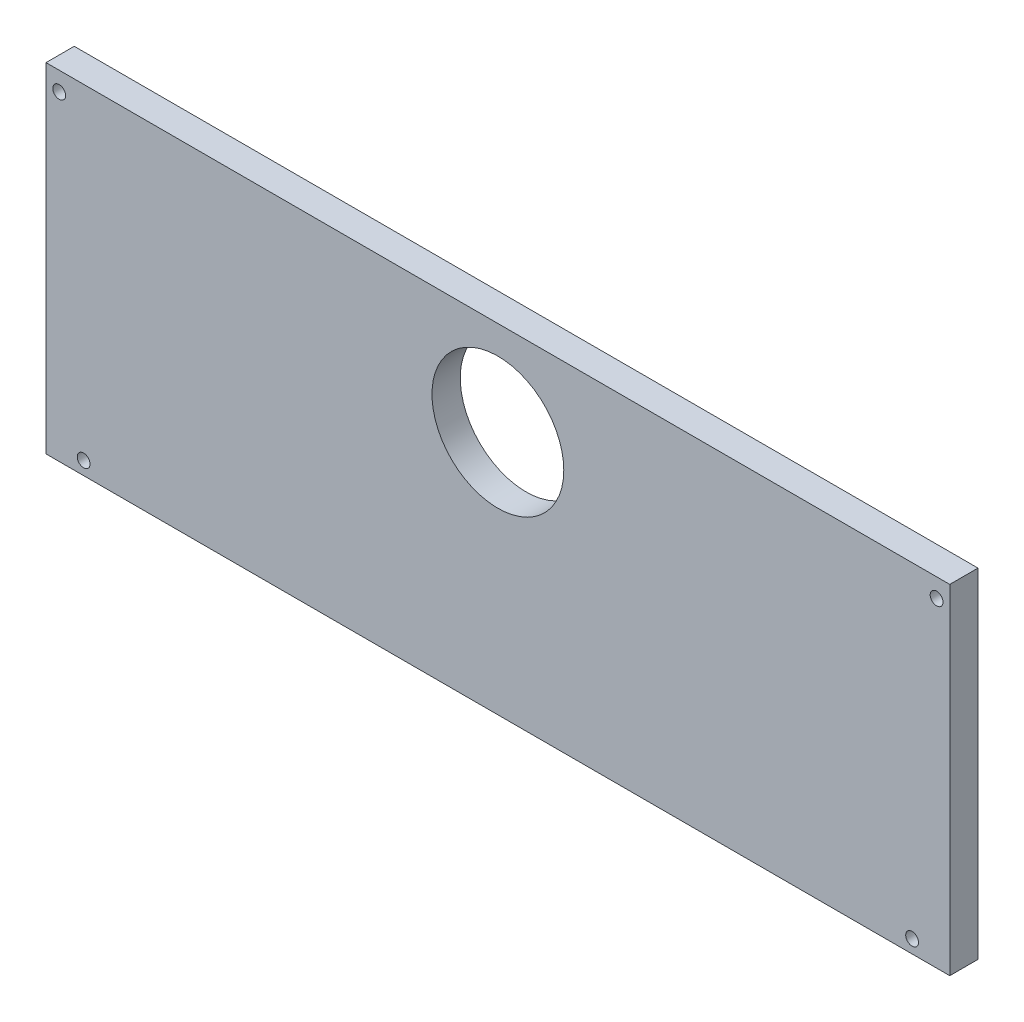
ISO-10303-21;
HEADER;
FILE_DESCRIPTION(('STEP AP214'),'2;1');
FILE_NAME('part.step','',(''),(''),'','','');
FILE_SCHEMA(('AUTOMOTIVE_DESIGN { 1 0 10303 214 1 1 1 1 }'));
ENDSEC;
DATA;
#1=APPLICATION_CONTEXT('core data for automotive mechanical design processes');
#2=APPLICATION_PROTOCOL_DEFINITION('international standard','automotive_design',2000,#1);
#3=PRODUCT_CONTEXT('',#1,'mechanical');
#4=PRODUCT('Part','Part','',(#3));
#5=PRODUCT_RELATED_PRODUCT_CATEGORY('part','',(#4));
#6=PRODUCT_DEFINITION_FORMATION('','',#4);
#7=PRODUCT_DEFINITION_CONTEXT('part definition',#1,'design');
#8=PRODUCT_DEFINITION('design','',#6,#7);
#9=PRODUCT_DEFINITION_SHAPE('','',#8);
#10=(LENGTH_UNIT() NAMED_UNIT(*) SI_UNIT(.MILLI.,.METRE.));
#11=(NAMED_UNIT(*) PLANE_ANGLE_UNIT() SI_UNIT($,.RADIAN.));
#12=(NAMED_UNIT(*) SI_UNIT($,.STERADIAN.) SOLID_ANGLE_UNIT());
#13=UNCERTAINTY_MEASURE_WITH_UNIT(LENGTH_MEASURE(1.E-05),#10,'distance_accuracy_value','');
#14=(GEOMETRIC_REPRESENTATION_CONTEXT(3) GLOBAL_UNCERTAINTY_ASSIGNED_CONTEXT((#13)) GLOBAL_UNIT_ASSIGNED_CONTEXT((#10,
#11,#12)) REPRESENTATION_CONTEXT('',''));
#15=CARTESIAN_POINT('',(0.,0.,0.));
#16=DIRECTION('',(0.,0.,1.));
#17=DIRECTION('',(1.,0.,0.));
#18=AXIS2_PLACEMENT_3D('',#15,#16,#17);
#19=CARTESIAN_POINT('',(0.,0.,9.525));
#20=DIRECTION('',(0.,0.,-1.));
#21=DIRECTION('',(-1.,0.,0.));
#22=AXIS2_PLACEMENT_3D('',#19,#20,#21);
#23=PLANE('',#22);
#24=CARTESIAN_POINT('',(139.7,-78.105,9.525));
#25=DIRECTION('',(0.,0.,1.));
#26=DIRECTION('',(1.,0.,0.));
#27=AXIS2_PLACEMENT_3D('',#24,#25,#26);
#28=CIRCLE('',#27,2.15899999999999);
#29=CARTESIAN_POINT('',(141.859,-78.105,9.525));
#30=VERTEX_POINT('',#29);
#31=EDGE_CURVE('E148',#30,#30,#28,.T.);
#32=ORIENTED_EDGE('',*,*,#31,.F.);
#33=EDGE_LOOP('',(#32));
#34=FACE_BOUND('',#33,.T.);
#35=CARTESIAN_POINT('',(147.955,25.4,9.525));
#36=DIRECTION('',(0.,0.,1.));
#37=DIRECTION('',(1.,0.,0.));
#38=AXIS2_PLACEMENT_3D('',#35,#36,#37);
#39=CIRCLE('',#38,2.15899999999999);
#40=CARTESIAN_POINT('',(150.114,25.4,9.525));
#41=VERTEX_POINT('',#40);
#42=EDGE_CURVE('E156',#41,#41,#39,.T.);
#43=ORIENTED_EDGE('',*,*,#42,.F.);
#44=EDGE_LOOP('',(#43));
#45=FACE_BOUND('',#44,.T.);
#46=CARTESIAN_POINT('',(-147.955,25.4,9.525));
#47=DIRECTION('',(0.,0.,1.));
#48=DIRECTION('',(1.,0.,0.));
#49=AXIS2_PLACEMENT_3D('',#46,#47,#48);
#50=CIRCLE('',#49,2.15899999999999);
#51=CARTESIAN_POINT('',(-145.796,25.4,9.525));
#52=VERTEX_POINT('',#51);
#53=EDGE_CURVE('E164',#52,#52,#50,.T.);
#54=ORIENTED_EDGE('',*,*,#53,.F.);
#55=EDGE_LOOP('',(#54));
#56=FACE_BOUND('',#55,.T.);
#57=CARTESIAN_POINT('',(-139.7,-78.105,9.525));
#58=DIRECTION('',(0.,0.,1.));
#59=DIRECTION('',(1.,0.,0.));
#60=AXIS2_PLACEMENT_3D('',#57,#58,#59);
#61=CIRCLE('',#60,2.15899999999999);
#62=CARTESIAN_POINT('',(-137.541,-78.105,9.525));
#63=VERTEX_POINT('',#62);
#64=EDGE_CURVE('E140',#63,#63,#61,.T.);
#65=ORIENTED_EDGE('',*,*,#64,.F.);
#66=EDGE_LOOP('',(#65));
#67=FACE_BOUND('',#66,.T.);
#68=DIRECTION('',(0.,-1.,0.));
#69=VECTOR('',#68,1.);
#70=CARTESIAN_POINT('',(-152.4,-82.55,9.525));
#71=LINE('',#70,#69);
#72=CARTESIAN_POINT('',(-152.4,31.75,9.525));
#73=VERTEX_POINT('',#72);
#74=CARTESIAN_POINT('',(-152.4,-82.55,9.525));
#75=VERTEX_POINT('',#74);
#76=EDGE_CURVE('E94',#73,#75,#71,.T.);
#77=ORIENTED_EDGE('',*,*,#76,.T.);
#78=DIRECTION('',(1.,0.,0.));
#79=VECTOR('',#78,1.);
#80=CARTESIAN_POINT('',(-152.4,-82.55,9.525));
#81=LINE('',#80,#79);
#82=CARTESIAN_POINT('',(152.4,-82.55,9.525));
#83=VERTEX_POINT('',#82);
#84=EDGE_CURVE('E89',#75,#83,#81,.T.);
#85=ORIENTED_EDGE('',*,*,#84,.T.);
#86=DIRECTION('',(0.,1.,0.));
#87=VECTOR('',#86,1.);
#88=CARTESIAN_POINT('',(152.4,-82.55,9.525));
#89=LINE('',#88,#87);
#90=CARTESIAN_POINT('',(152.4,31.75,9.525));
#91=VERTEX_POINT('',#90);
#92=EDGE_CURVE('E92',#83,#91,#89,.T.);
#93=ORIENTED_EDGE('',*,*,#92,.T.);
#94=DIRECTION('',(-1.,0.,0.));
#95=VECTOR('',#94,1.);
#96=CARTESIAN_POINT('',(-152.4,31.75,9.525));
#97=LINE('',#96,#95);
#98=EDGE_CURVE('E59',#91,#73,#97,.T.);
#99=ORIENTED_EDGE('',*,*,#98,.T.);
#100=EDGE_LOOP('',(#77,#85,#93,#99));
#101=FACE_BOUND('',#100,.T.);
#102=CARTESIAN_POINT('',(0.,0.,9.525));
#103=DIRECTION('',(0.,0.,1.));
#104=DIRECTION('',(1.,0.,0.));
#105=AXIS2_PLACEMENT_3D('',#102,#103,#104);
#106=CIRCLE('',#105,22.225);
#107=CARTESIAN_POINT('',(22.225,0.,9.525));
#108=VERTEX_POINT('',#107);
#109=EDGE_CURVE('E114',#108,#108,#106,.T.);
#110=ORIENTED_EDGE('',*,*,#109,.F.);
#111=EDGE_LOOP('',(#110));
#112=FACE_BOUND('',#111,.T.);
#113=ADVANCED_FACE('F41',(#34,#45,#56,#67,#101,#112),#23,.F.);
#114=CARTESIAN_POINT('',(0.,0.,0.));
#115=DIRECTION('',(0.,0.,-1.));
#116=DIRECTION('',(-1.,0.,0.));
#117=AXIS2_PLACEMENT_3D('',#114,#115,#116);
#118=PLANE('',#117);
#119=CARTESIAN_POINT('',(139.7,-78.105,0.));
#120=DIRECTION('',(0.,0.,1.));
#121=DIRECTION('',(1.,0.,0.));
#122=AXIS2_PLACEMENT_3D('',#119,#120,#121);
#123=CIRCLE('',#122,2.15899999999999);
#124=CARTESIAN_POINT('',(141.859,-78.105,0.));
#125=VERTEX_POINT('',#124);
#126=EDGE_CURVE('E152',#125,#125,#123,.T.);
#127=ORIENTED_EDGE('',*,*,#126,.T.);
#128=EDGE_LOOP('',(#127));
#129=FACE_BOUND('',#128,.T.);
#130=CARTESIAN_POINT('',(147.955,25.4,0.));
#131=DIRECTION('',(0.,0.,1.));
#132=DIRECTION('',(1.,0.,0.));
#133=AXIS2_PLACEMENT_3D('',#130,#131,#132);
#134=CIRCLE('',#133,2.15899999999999);
#135=CARTESIAN_POINT('',(150.114,25.4,0.));
#136=VERTEX_POINT('',#135);
#137=EDGE_CURVE('E160',#136,#136,#134,.T.);
#138=ORIENTED_EDGE('',*,*,#137,.T.);
#139=EDGE_LOOP('',(#138));
#140=FACE_BOUND('',#139,.T.);
#141=CARTESIAN_POINT('',(-147.955,25.4,0.));
#142=DIRECTION('',(0.,0.,1.));
#143=DIRECTION('',(1.,0.,0.));
#144=AXIS2_PLACEMENT_3D('',#141,#142,#143);
#145=CIRCLE('',#144,2.15899999999999);
#146=CARTESIAN_POINT('',(-145.796,25.4,0.));
#147=VERTEX_POINT('',#146);
#148=EDGE_CURVE('E144',#147,#147,#145,.T.);
#149=ORIENTED_EDGE('',*,*,#148,.T.);
#150=EDGE_LOOP('',(#149));
#151=FACE_BOUND('',#150,.T.);
#152=CARTESIAN_POINT('',(-139.7,-78.105,0.));
#153=DIRECTION('',(0.,0.,1.));
#154=DIRECTION('',(1.,0.,0.));
#155=AXIS2_PLACEMENT_3D('',#152,#153,#154);
#156=CIRCLE('',#155,2.15899999999999);
#157=CARTESIAN_POINT('',(-137.541,-78.105,0.));
#158=VERTEX_POINT('',#157);
#159=EDGE_CURVE('E136',#158,#158,#156,.T.);
#160=ORIENTED_EDGE('',*,*,#159,.T.);
#161=EDGE_LOOP('',(#160));
#162=FACE_BOUND('',#161,.T.);
#163=DIRECTION('',(0.,-1.,0.));
#164=VECTOR('',#163,1.);
#165=CARTESIAN_POINT('',(-152.4,-82.55,0.));
#166=LINE('',#165,#164);
#167=CARTESIAN_POINT('',(-152.4,31.75,0.));
#168=VERTEX_POINT('',#167);
#169=CARTESIAN_POINT('',(-152.4,-82.55,0.));
#170=VERTEX_POINT('',#169);
#171=EDGE_CURVE('E110',#168,#170,#166,.T.);
#172=ORIENTED_EDGE('',*,*,#171,.F.);
#173=DIRECTION('',(-1.,0.,0.));
#174=VECTOR('',#173,1.);
#175=CARTESIAN_POINT('',(-152.4,31.75,0.));
#176=LINE('',#175,#174);
#177=CARTESIAN_POINT('',(152.4,31.75,0.));
#178=VERTEX_POINT('',#177);
#179=EDGE_CURVE('E82',#178,#168,#176,.T.);
#180=ORIENTED_EDGE('',*,*,#179,.F.);
#181=DIRECTION('',(0.,1.,0.));
#182=VECTOR('',#181,1.);
#183=CARTESIAN_POINT('',(152.4,-82.55,0.));
#184=LINE('',#183,#182);
#185=CARTESIAN_POINT('',(152.4,-82.55,0.));
#186=VERTEX_POINT('',#185);
#187=EDGE_CURVE('E76',#186,#178,#184,.T.);
#188=ORIENTED_EDGE('',*,*,#187,.F.);
#189=DIRECTION('',(1.,0.,0.));
#190=VECTOR('',#189,1.);
#191=CARTESIAN_POINT('',(-152.4,-82.55,0.));
#192=LINE('',#191,#190);
#193=EDGE_CURVE('E99',#170,#186,#192,.T.);
#194=ORIENTED_EDGE('',*,*,#193,.F.);
#195=EDGE_LOOP('',(#172,#180,#188,#194));
#196=FACE_BOUND('',#195,.T.);
#197=CARTESIAN_POINT('',(0.,0.,0.));
#198=DIRECTION('',(0.,0.,1.));
#199=DIRECTION('',(1.,0.,0.));
#200=AXIS2_PLACEMENT_3D('',#197,#198,#199);
#201=CIRCLE('',#200,22.225);
#202=CARTESIAN_POINT('',(22.225,0.,0.));
#203=VERTEX_POINT('',#202);
#204=EDGE_CURVE('E132',#203,#203,#201,.T.);
#205=ORIENTED_EDGE('',*,*,#204,.T.);
#206=EDGE_LOOP('',(#205));
#207=FACE_BOUND('',#206,.T.);
#208=ADVANCED_FACE('F127',(#129,#140,#151,#162,#196,#207),#118,.T.);
#209=CARTESIAN_POINT('',(-152.4,-82.55,9.525));
#210=DIRECTION('',(1.,0.,0.));
#211=DIRECTION('',(0.,0.,-1.));
#212=AXIS2_PLACEMENT_3D('',#209,#210,#211);
#213=PLANE('',#212);
#214=ORIENTED_EDGE('',*,*,#171,.T.);
#215=DIRECTION('',(0.,0.,-1.));
#216=VECTOR('',#215,1.);
#217=CARTESIAN_POINT('',(-152.4,-82.55,9.525));
#218=LINE('',#217,#216);
#219=EDGE_CURVE('E11',#75,#170,#218,.T.);
#220=ORIENTED_EDGE('',*,*,#219,.F.);
#221=ORIENTED_EDGE('',*,*,#76,.F.);
#222=DIRECTION('',(0.,0.,-1.));
#223=VECTOR('',#222,1.);
#224=CARTESIAN_POINT('',(-152.4,31.75,9.525));
#225=LINE('',#224,#223);
#226=EDGE_CURVE('E106',#73,#168,#225,.T.);
#227=ORIENTED_EDGE('',*,*,#226,.T.);
#228=EDGE_LOOP('',(#214,#220,#221,#227));
#229=FACE_BOUND('',#228,.T.);
#230=ADVANCED_FACE('F43',(#229),#213,.F.);
#231=CARTESIAN_POINT('',(-152.4,-82.55,9.525));
#232=DIRECTION('',(0.,1.,0.));
#233=DIRECTION('',(0.,0.,1.));
#234=AXIS2_PLACEMENT_3D('',#231,#232,#233);
#235=PLANE('',#234);
#236=ORIENTED_EDGE('',*,*,#193,.T.);
#237=DIRECTION('',(0.,0.,-1.));
#238=VECTOR('',#237,1.);
#239=CARTESIAN_POINT('',(152.4,-82.55,9.525));
#240=LINE('',#239,#238);
#241=EDGE_CURVE('E51',#83,#186,#240,.T.);
#242=ORIENTED_EDGE('',*,*,#241,.F.);
#243=ORIENTED_EDGE('',*,*,#84,.F.);
#244=ORIENTED_EDGE('',*,*,#219,.T.);
#245=EDGE_LOOP('',(#236,#242,#243,#244));
#246=FACE_BOUND('',#245,.T.);
#247=ADVANCED_FACE('F98',(#246),#235,.F.);
#248=CARTESIAN_POINT('',(152.4,-82.55,9.525));
#249=DIRECTION('',(-1.,0.,0.));
#250=DIRECTION('',(0.,0.,1.));
#251=AXIS2_PLACEMENT_3D('',#248,#249,#250);
#252=PLANE('',#251);
#253=ORIENTED_EDGE('',*,*,#187,.T.);
#254=DIRECTION('',(0.,0.,-1.));
#255=VECTOR('',#254,1.);
#256=CARTESIAN_POINT('',(152.4,31.75,9.525));
#257=LINE('',#256,#255);
#258=EDGE_CURVE('E101',#91,#178,#257,.T.);
#259=ORIENTED_EDGE('',*,*,#258,.F.);
#260=ORIENTED_EDGE('',*,*,#92,.F.);
#261=ORIENTED_EDGE('',*,*,#241,.T.);
#262=EDGE_LOOP('',(#253,#259,#260,#261));
#263=FACE_BOUND('',#262,.T.);
#264=ADVANCED_FACE('F102',(#263),#252,.F.);
#265=CARTESIAN_POINT('',(-152.4,31.75,9.525));
#266=DIRECTION('',(0.,-1.,0.));
#267=DIRECTION('',(0.,0.,-1.));
#268=AXIS2_PLACEMENT_3D('',#265,#266,#267);
#269=PLANE('',#268);
#270=ORIENTED_EDGE('',*,*,#179,.T.);
#271=ORIENTED_EDGE('',*,*,#226,.F.);
#272=ORIENTED_EDGE('',*,*,#98,.F.);
#273=ORIENTED_EDGE('',*,*,#258,.T.);
#274=EDGE_LOOP('',(#270,#271,#272,#273));
#275=FACE_BOUND('',#274,.T.);
#276=ADVANCED_FACE('F124',(#275),#269,.F.);
#277=CARTESIAN_POINT('',(0.,0.,9.525));
#278=DIRECTION('',(0.,0.,-1.));
#279=DIRECTION('',(-1.,0.,0.));
#280=AXIS2_PLACEMENT_3D('',#277,#278,#279);
#281=CYLINDRICAL_SURFACE('',#280,22.225);
#282=ORIENTED_EDGE('',*,*,#109,.T.);
#283=EDGE_LOOP('',(#282));
#284=FACE_BOUND('',#283,.T.);
#285=ORIENTED_EDGE('',*,*,#204,.F.);
#286=EDGE_LOOP('',(#285));
#287=FACE_BOUND('',#286,.T.);
#288=ADVANCED_FACE('F189',(#284,#287),#281,.F.);
#289=CARTESIAN_POINT('',(-139.7,-78.105,0.));
#290=DIRECTION('',(0.,0.,1.));
#291=DIRECTION('',(1.,0.,0.));
#292=AXIS2_PLACEMENT_3D('',#289,#290,#291);
#293=CYLINDRICAL_SURFACE('',#292,2.15899999999999);
#294=ORIENTED_EDGE('',*,*,#159,.F.);
#295=EDGE_LOOP('',(#294));
#296=FACE_BOUND('',#295,.T.);
#297=ORIENTED_EDGE('',*,*,#64,.T.);
#298=EDGE_LOOP('',(#297));
#299=FACE_BOUND('',#298,.T.);
#300=ADVANCED_FACE('F178',(#296,#299),#293,.F.);
#301=CARTESIAN_POINT('',(-147.955,25.4,0.));
#302=DIRECTION('',(0.,0.,1.));
#303=DIRECTION('',(1.,0.,0.));
#304=AXIS2_PLACEMENT_3D('',#301,#302,#303);
#305=CYLINDRICAL_SURFACE('',#304,2.15899999999999);
#306=ORIENTED_EDGE('',*,*,#148,.F.);
#307=EDGE_LOOP('',(#306));
#308=FACE_BOUND('',#307,.T.);
#309=ORIENTED_EDGE('',*,*,#53,.T.);
#310=EDGE_LOOP('',(#309));
#311=FACE_BOUND('',#310,.T.);
#312=ADVANCED_FACE('F174',(#308,#311),#305,.F.);
#313=CARTESIAN_POINT('',(147.955,25.4,0.));
#314=DIRECTION('',(0.,0.,1.));
#315=DIRECTION('',(1.,0.,0.));
#316=AXIS2_PLACEMENT_3D('',#313,#314,#315);
#317=CYLINDRICAL_SURFACE('',#316,2.15899999999999);
#318=ORIENTED_EDGE('',*,*,#137,.F.);
#319=EDGE_LOOP('',(#318));
#320=FACE_BOUND('',#319,.T.);
#321=ORIENTED_EDGE('',*,*,#42,.T.);
#322=EDGE_LOOP('',(#321));
#323=FACE_BOUND('',#322,.T.);
#324=ADVANCED_FACE('F177',(#320,#323),#317,.F.);
#325=CARTESIAN_POINT('',(139.7,-78.105,0.));
#326=DIRECTION('',(0.,0.,1.));
#327=DIRECTION('',(1.,0.,0.));
#328=AXIS2_PLACEMENT_3D('',#325,#326,#327);
#329=CYLINDRICAL_SURFACE('',#328,2.15899999999999);
#330=ORIENTED_EDGE('',*,*,#126,.F.);
#331=EDGE_LOOP('',(#330));
#332=FACE_BOUND('',#331,.T.);
#333=ORIENTED_EDGE('',*,*,#31,.T.);
#334=EDGE_LOOP('',(#333));
#335=FACE_BOUND('',#334,.T.);
#336=ADVANCED_FACE('F199',(#332,#335),#329,.F.);
#337=CLOSED_SHELL('',(#113,#208,#230,#247,#264,#276,#288,#300,#312,#324,#336));
#338=MANIFOLD_SOLID_BREP('B2',#337);
#339=ADVANCED_BREP_SHAPE_REPRESENTATION('',(#18,#338),#14);
#340=SHAPE_DEFINITION_REPRESENTATION(#9,#339);
ENDSEC;
END-ISO-10303-21;
